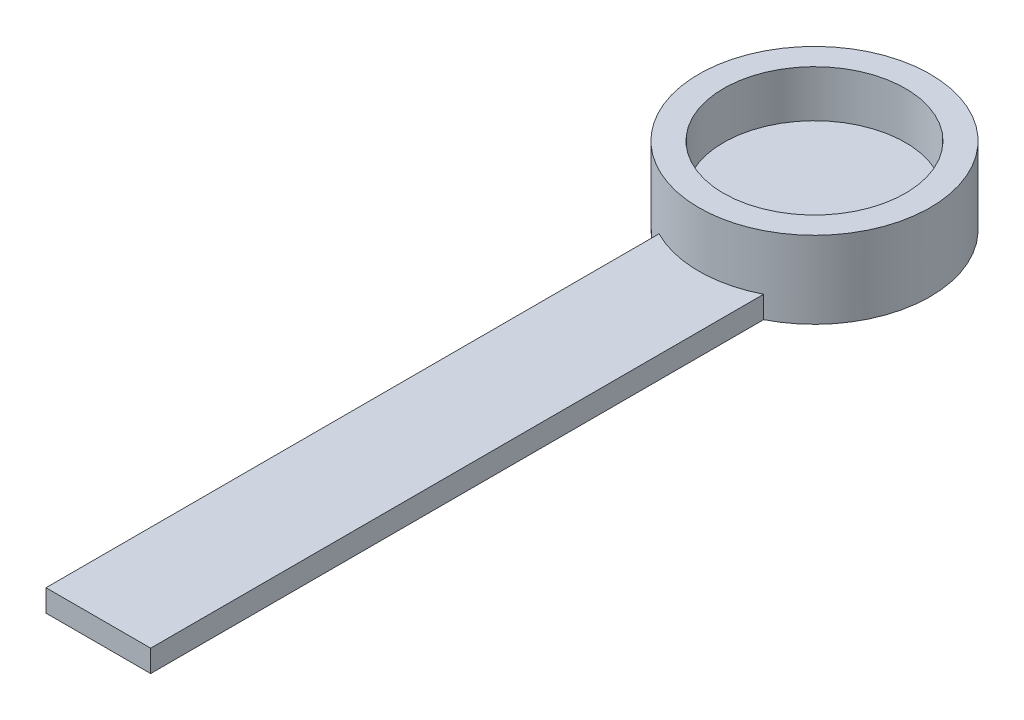
ISO-10303-21;
HEADER;
FILE_DESCRIPTION(('STEP AP214'),'2;1');
FILE_NAME('part.step','',(''),(''),'','','');
FILE_SCHEMA(('AUTOMOTIVE_DESIGN { 1 0 10303 214 1 1 1 1 }'));
ENDSEC;
DATA;
#1=APPLICATION_CONTEXT('core data for automotive mechanical design processes');
#2=APPLICATION_PROTOCOL_DEFINITION('international standard','automotive_design',2000,#1);
#3=PRODUCT_CONTEXT('',#1,'mechanical');
#4=PRODUCT('Part','Part','',(#3));
#5=PRODUCT_RELATED_PRODUCT_CATEGORY('part','',(#4));
#6=PRODUCT_DEFINITION_FORMATION('','',#4);
#7=PRODUCT_DEFINITION_CONTEXT('part definition',#1,'design');
#8=PRODUCT_DEFINITION('design','',#6,#7);
#9=PRODUCT_DEFINITION_SHAPE('','',#8);
#10=(LENGTH_UNIT() NAMED_UNIT(*) SI_UNIT(.MILLI.,.METRE.));
#11=(NAMED_UNIT(*) PLANE_ANGLE_UNIT() SI_UNIT($,.RADIAN.));
#12=(NAMED_UNIT(*) SI_UNIT($,.STERADIAN.) SOLID_ANGLE_UNIT());
#13=UNCERTAINTY_MEASURE_WITH_UNIT(LENGTH_MEASURE(1.E-05),#10,'distance_accuracy_value','');
#14=(GEOMETRIC_REPRESENTATION_CONTEXT(3) GLOBAL_UNCERTAINTY_ASSIGNED_CONTEXT((#13)) GLOBAL_UNIT_ASSIGNED_CONTEXT((#10,
#11,#12)) REPRESENTATION_CONTEXT('',''));
#15=CARTESIAN_POINT('',(0.,0.,0.));
#16=DIRECTION('',(0.,0.,1.));
#17=DIRECTION('',(1.,0.,0.));
#18=AXIS2_PLACEMENT_3D('',#15,#16,#17);
#19=CARTESIAN_POINT('',(0.,7.,0.));
#20=DIRECTION('',(0.,-1.,0.));
#21=DIRECTION('',(0.,0.,-1.));
#22=AXIS2_PLACEMENT_3D('',#19,#20,#21);
#23=CYLINDRICAL_SURFACE('',#22,8.25);
#24=CARTESIAN_POINT('',(0.,7.,0.));
#25=DIRECTION('',(0.,1.,0.));
#26=DIRECTION('',(0.,0.,1.));
#27=AXIS2_PLACEMENT_3D('',#24,#25,#26);
#28=CIRCLE('',#27,8.25);
#29=CARTESIAN_POINT('',(0.,7.,8.25));
#30=VERTEX_POINT('',#29);
#31=EDGE_CURVE('E206',#30,#30,#28,.T.);
#32=ORIENTED_EDGE('',*,*,#31,.T.);
#33=EDGE_LOOP('',(#32));
#34=FACE_BOUND('',#33,.T.);
#35=CARTESIAN_POINT('',(0.,4.75,0.));
#36=DIRECTION('',(0.,1.,0.));
#37=DIRECTION('',(0.,0.,1.));
#38=AXIS2_PLACEMENT_3D('',#35,#36,#37);
#39=CIRCLE('',#38,8.25);
#40=CARTESIAN_POINT('',(-0.75,4.75,8.21583836257749));
#41=VERTEX_POINT('',#40);
#42=CARTESIAN_POINT('',(0.75,4.75,8.21583836257749));
#43=VERTEX_POINT('',#42);
#44=EDGE_CURVE('E184',#41,#43,#39,.T.);
#45=ORIENTED_EDGE('',*,*,#44,.F.);
#46=CARTESIAN_POINT('',(-0.75,4.75,8.21583836257749));
#47=CARTESIAN_POINT('',(-0.764129221551779,4.75001161341339,8.21454996122284));
#48=CARTESIAN_POINT('',(-0.778251039669117,4.74880290447525,8.21322269564521));
#49=CARTESIAN_POINT('',(-0.806078895124546,4.74403425371426,8.21053749097257));
#50=CARTESIAN_POINT('',(-0.819785226220468,4.7404760156203,8.20917957479202));
#51=CARTESIAN_POINT('',(-0.84640883031633,4.73109533210837,8.20647750519365));
#52=CARTESIAN_POINT('',(-0.859325739010222,4.72527185031039,8.2051333583648));
#53=CARTESIAN_POINT('',(-0.883995941785533,4.71152851564804,8.20251210094606));
#54=CARTESIAN_POINT('',(-0.895749441725187,4.70360903457258,8.20123497851545));
#55=CARTESIAN_POINT('',(-0.917753098340607,4.68589854866679,8.19880186707717));
#56=CARTESIAN_POINT('',(-0.92800413804788,4.67610865098213,8.19764580703327));
#57=CARTESIAN_POINT('',(-0.94671693028953,4.65492627305538,8.19550583979909));
#58=CARTESIAN_POINT('',(-0.955178364048698,4.64353350790186,8.19452196328455));
#59=CARTESIAN_POINT('',(-0.970026706937175,4.61952665823131,8.19277755291973));
#60=CARTESIAN_POINT('',(-0.976422965343667,4.60691842322988,8.19201601406737));
#61=CARTESIAN_POINT('',(-0.987002101335757,4.58079734052133,8.19074816084985));
#62=CARTESIAN_POINT('',(-0.991186488854643,4.56728511703882,8.19024167238579));
#63=CARTESIAN_POINT('',(-0.996129852529126,4.54473499724551,8.18964156950122));
#64=CARTESIAN_POINT('',(-0.997580242977253,4.53584482180575,8.18946489561978));
#65=CARTESIAN_POINT('',(-0.999515169190639,4.51797107836416,8.18922888383138));
#66=CARTESIAN_POINT('',(-1.00000105495711,4.5089876586163,8.18916938192169));
#67=CARTESIAN_POINT('',(-1.00000000000077,4.50000000000016,8.18916967707999));
#68=B_SPLINE_CURVE_WITH_KNOTS('',3,(#46,#47,#48,#49,#50,#51,#52,#53,#54,#55,#56,#57,#58,#59,#60,
#61,#62,#63,#64,#65,#66,#67),.UNSPECIFIED.,.F.,.F.,(4,2,2,2,2,2,2,2,2,2,4),(0.,
0.0425066362152133,0.084982483124767,0.127477786215973,0.169965556524714,0.212428254759499,
0.254898510343261,0.297173710996858,0.339420015100162,0.366399209454952,0.393340614776967),.UNSPECIFIED.);
#69=CARTESIAN_POINT('',(-1.,4.5,8.1891696770796));
#70=VERTEX_POINT('',#69);
#71=EDGE_CURVE('E252',#41,#70,#68,.T.);
#72=ORIENTED_EDGE('',*,*,#71,.T.);
#73=DIRECTION('',(0.,-1.,0.));
#74=VECTOR('',#73,1.);
#75=CARTESIAN_POINT('',(-1.,4.75,8.1891696770796));
#76=LINE('',#75,#74);
#77=CARTESIAN_POINT('',(-1.,2.75,8.1891696770796));
#78=VERTEX_POINT('',#77);
#79=EDGE_CURVE('E203',#70,#78,#76,.T.);
#80=ORIENTED_EDGE('',*,*,#79,.T.);
#81=CARTESIAN_POINT('',(0.,2.75,0.));
#82=DIRECTION('',(0.,1.,0.));
#83=DIRECTION('',(0.,0.,1.));
#84=AXIS2_PLACEMENT_3D('',#81,#82,#83);
#85=CIRCLE('',#84,8.25);
#86=CARTESIAN_POINT('',(1.,2.75,8.1891696770796));
#87=VERTEX_POINT('',#86);
#88=EDGE_CURVE('E217',#78,#87,#85,.F.);
#89=ORIENTED_EDGE('',*,*,#88,.T.);
#90=DIRECTION('',(0.,-1.,0.));
#91=VECTOR('',#90,1.);
#92=CARTESIAN_POINT('',(0.999999999999999,4.75,8.1891696770796));
#93=LINE('',#92,#91);
#94=CARTESIAN_POINT('',(0.999999999999999,4.5,8.1891696770796));
#95=VERTEX_POINT('',#94);
#96=EDGE_CURVE('E188',#95,#87,#93,.T.);
#97=ORIENTED_EDGE('',*,*,#96,.F.);
#98=CARTESIAN_POINT('',(1.,4.5,8.1891696770796));
#99=CARTESIAN_POINT('',(1.00001226422762,4.51399502917828,8.18916715775935));
#100=CARTESIAN_POINT('',(0.998825589352925,4.52798573053127,8.18931307201345));
#101=CARTESIAN_POINT('',(0.994145793215527,4.55555599314485,8.18988303424555));
#102=CARTESIAN_POINT('',(0.990655035739588,4.56913596086538,8.1903067971722));
#103=CARTESIAN_POINT('',(0.981456358849237,4.59551771046388,8.1914140112854));
#104=CARTESIAN_POINT('',(0.975747569415343,4.60831918469741,8.19209756437193));
#105=CARTESIAN_POINT('',(0.962284101281528,4.63277883580666,8.19368997383611));
#106=CARTESIAN_POINT('',(0.954529635175436,4.64443713131291,8.19459880680131));
#107=CARTESIAN_POINT('',(0.937164103851531,4.66632969079791,8.19660294280925));
#108=CARTESIAN_POINT('',(0.927546298355228,4.67655854554457,8.19769892105363));
#109=CARTESIAN_POINT('',(0.906744127348434,4.69526118400607,8.2000258794824));
#110=CARTESIAN_POINT('',(0.895559424028606,4.70373458828223,8.20125688876584));
#111=CARTESIAN_POINT('',(0.871861091489875,4.71874177501779,8.20381015546245));
#112=CARTESIAN_POINT('',(0.859339066991687,4.72526219285857,8.20513296856957));
#113=CARTESIAN_POINT('',(0.833382955048964,4.73610341320482,8.20780985583175));
#114=CARTESIAN_POINT('',(0.819949361588187,4.74042539643302,8.20916391279714));
#115=CARTESIAN_POINT('',(0.797034475048519,4.74571830400974,8.21141413192285));
#116=CARTESIAN_POINT('',(0.787695004810799,4.74732263761865,8.21231543373788));
#117=CARTESIAN_POINT('',(0.768905499457665,4.74946341565931,8.21409606931658));
#118=CARTESIAN_POINT('',(0.759455632937118,4.75000131689845,8.21497543142632));
#119=CARTESIAN_POINT('',(0.750000000000396,4.75000000000171,8.21583836257751));
#120=B_SPLINE_CURVE_WITH_KNOTS('',3,(#98,#99,#100,#101,#102,#103,#104,#105,#106,#107,#108,#109,
#110,#111,#112,#113,#114,#115,#116,#117,#118,#119),.UNSPECIFIED.,.F.,.F.,(4,2,2,2,2,2,2,2,2,2,
4),(0.,0.0419277652389413,0.0838125829838669,0.125713846594998,0.167610757395424,
0.209662151688062,0.251722625881799,0.294064675425708,0.336383960068434,0.364884263259365,
0.393345606512269),.UNSPECIFIED.);
#121=EDGE_CURVE('E261',#95,#43,#120,.T.);
#122=ORIENTED_EDGE('',*,*,#121,.T.);
#123=EDGE_LOOP('',(#45,#72,#80,#89,#97,#122));
#124=FACE_BOUND('',#123,.T.);
#125=ADVANCED_FACE('F47',(#34,#124),#23,.F.);
#126=CARTESIAN_POINT('',(0.,2.75,0.));
#127=DIRECTION('',(0.,1.,0.));
#128=DIRECTION('',(0.,0.,1.));
#129=AXIS2_PLACEMENT_3D('',#126,#127,#128);
#130=PLANE('',#129);
#131=ORIENTED_EDGE('',*,*,#88,.F.);
#132=DIRECTION('',(0.,0.,1.));
#133=VECTOR('',#132,1.);
#134=CARTESIAN_POINT('',(-1.,2.75,8.1891696770796));
#135=LINE('',#134,#133);
#136=CARTESIAN_POINT('',(-1.,2.75,7.3));
#137=VERTEX_POINT('',#136);
#138=EDGE_CURVE('E194',#137,#78,#135,.T.);
#139=ORIENTED_EDGE('',*,*,#138,.F.);
#140=CARTESIAN_POINT('',(-0.75,2.75,7.3));
#141=DIRECTION('',(0.,1.,0.));
#142=DIRECTION('',(0.,0.,1.));
#143=AXIS2_PLACEMENT_3D('',#140,#141,#142);
#144=CIRCLE('',#143,0.25);
#145=CARTESIAN_POINT('',(-0.75,2.75,7.05));
#146=VERTEX_POINT('',#145);
#147=EDGE_CURVE('E11',#137,#146,#144,.F.);
#148=ORIENTED_EDGE('',*,*,#147,.T.);
#149=DIRECTION('',(-1.,0.,0.));
#150=VECTOR('',#149,1.);
#151=CARTESIAN_POINT('',(-1.,2.75,7.05));
#152=LINE('',#151,#150);
#153=CARTESIAN_POINT('',(0.75,2.75,7.05));
#154=VERTEX_POINT('',#153);
#155=EDGE_CURVE('E190',#154,#146,#152,.T.);
#156=ORIENTED_EDGE('',*,*,#155,.F.);
#157=CARTESIAN_POINT('',(0.75,2.75,7.3));
#158=DIRECTION('',(0.,1.,0.));
#159=DIRECTION('',(0.,0.,1.));
#160=AXIS2_PLACEMENT_3D('',#157,#158,#159);
#161=CIRCLE('',#160,0.25);
#162=CARTESIAN_POINT('',(1.,2.75,7.3));
#163=VERTEX_POINT('',#162);
#164=EDGE_CURVE('E57',#154,#163,#161,.F.);
#165=ORIENTED_EDGE('',*,*,#164,.T.);
#166=DIRECTION('',(0.,0.,-1.));
#167=VECTOR('',#166,1.);
#168=CARTESIAN_POINT('',(1.,2.75,7.05));
#169=LINE('',#168,#167);
#170=EDGE_CURVE('E189',#87,#163,#169,.T.);
#171=ORIENTED_EDGE('',*,*,#170,.F.);
#172=EDGE_LOOP('',(#131,#139,#148,#156,#165,#171));
#173=FACE_BOUND('',#172,.T.);
#174=ADVANCED_FACE('F275',(#173),#130,.T.);
#175=CARTESIAN_POINT('',(0.,2.75,0.));
#176=DIRECTION('',(0.,-1.,0.));
#177=DIRECTION('',(0.,0.,-1.));
#178=AXIS2_PLACEMENT_3D('',#175,#176,#177);
#179=CYLINDRICAL_SURFACE('',#178,10.5);
#180=CARTESIAN_POINT('',(0.,2.,0.));
#181=DIRECTION('',(0.,1.,0.));
#182=DIRECTION('',(0.,0.,-1.));
#183=AXIS2_PLACEMENT_3D('',#180,#181,#182);
#184=CIRCLE('',#183,10.5);
#185=CARTESIAN_POINT('',(-4.75,2.,9.36416040016402));
#186=VERTEX_POINT('',#185);
#187=CARTESIAN_POINT('',(4.75,2.,9.36416040016402));
#188=VERTEX_POINT('',#187);
#189=EDGE_CURVE('E69',#186,#188,#184,.T.);
#190=ORIENTED_EDGE('',*,*,#189,.T.);
#191=DIRECTION('',(0.,-1.,0.));
#192=VECTOR('',#191,1.);
#193=CARTESIAN_POINT('',(4.75,2.,9.36416040016402));
#194=LINE('',#193,#192);
#195=CARTESIAN_POINT('',(4.75,0.,9.36416040016402));
#196=VERTEX_POINT('',#195);
#197=EDGE_CURVE('E179',#188,#196,#194,.T.);
#198=ORIENTED_EDGE('',*,*,#197,.T.);
#199=CARTESIAN_POINT('',(0.,0.,0.));
#200=DIRECTION('',(0.,1.,0.));
#201=DIRECTION('',(0.,0.,1.));
#202=AXIS2_PLACEMENT_3D('',#199,#200,#201);
#203=CIRCLE('',#202,10.5);
#204=CARTESIAN_POINT('',(-4.75,0.,9.36416040016402));
#205=VERTEX_POINT('',#204);
#206=EDGE_CURVE('E214',#196,#205,#203,.T.);
#207=ORIENTED_EDGE('',*,*,#206,.T.);
#208=DIRECTION('',(0.,-1.,0.));
#209=VECTOR('',#208,1.);
#210=CARTESIAN_POINT('',(-4.75,2.,9.36416040016402));
#211=LINE('',#210,#209);
#212=EDGE_CURVE('E65',#186,#205,#211,.T.);
#213=ORIENTED_EDGE('',*,*,#212,.F.);
#214=EDGE_LOOP('',(#190,#198,#207,#213));
#215=FACE_BOUND('',#214,.T.);
#216=CARTESIAN_POINT('',(0.,7.,0.));
#217=DIRECTION('',(0.,1.,0.));
#218=DIRECTION('',(0.,0.,1.));
#219=AXIS2_PLACEMENT_3D('',#216,#217,#218);
#220=CIRCLE('',#219,10.5);
#221=CARTESIAN_POINT('',(0.,7.,10.5));
#222=VERTEX_POINT('',#221);
#223=EDGE_CURVE('E210',#222,#222,#220,.T.);
#224=ORIENTED_EDGE('',*,*,#223,.F.);
#225=EDGE_LOOP('',(#224));
#226=FACE_BOUND('',#225,.T.);
#227=ADVANCED_FACE('F287',(#215,#226),#179,.T.);
#228=CARTESIAN_POINT('',(0.,0.,0.));
#229=DIRECTION('',(0.,1.,0.));
#230=DIRECTION('',(0.,0.,1.));
#231=AXIS2_PLACEMENT_3D('',#228,#229,#230);
#232=PLANE('',#231);
#233=ORIENTED_EDGE('',*,*,#206,.F.);
#234=DIRECTION('',(0.,0.,1.));
#235=VECTOR('',#234,1.);
#236=CARTESIAN_POINT('',(4.75,0.,65.));
#237=LINE('',#236,#235);
#238=CARTESIAN_POINT('',(4.75,0.,65.));
#239=VERTEX_POINT('',#238);
#240=EDGE_CURVE('E161',#196,#239,#237,.T.);
#241=ORIENTED_EDGE('',*,*,#240,.T.);
#242=DIRECTION('',(-1.,0.,0.));
#243=VECTOR('',#242,1.);
#244=CARTESIAN_POINT('',(-4.75,0.,65.));
#245=LINE('',#244,#243);
#246=CARTESIAN_POINT('',(-4.75,0.,65.));
#247=VERTEX_POINT('',#246);
#248=EDGE_CURVE('E171',#239,#247,#245,.T.);
#249=ORIENTED_EDGE('',*,*,#248,.T.);
#250=DIRECTION('',(0.,0.,-1.));
#251=VECTOR('',#250,1.);
#252=CARTESIAN_POINT('',(-4.75,0.,9.36416040016402));
#253=LINE('',#252,#251);
#254=EDGE_CURVE('E142',#247,#205,#253,.T.);
#255=ORIENTED_EDGE('',*,*,#254,.T.);
#256=EDGE_LOOP('',(#233,#241,#249,#255));
#257=FACE_BOUND('',#256,.T.);
#258=ADVANCED_FACE('F283',(#257),#232,.F.);
#259=CARTESIAN_POINT('',(0.,7.,0.));
#260=DIRECTION('',(0.,1.,0.));
#261=DIRECTION('',(0.,0.,1.));
#262=AXIS2_PLACEMENT_3D('',#259,#260,#261);
#263=PLANE('',#262);
#264=ORIENTED_EDGE('',*,*,#223,.T.);
#265=EDGE_LOOP('',(#264));
#266=FACE_BOUND('',#265,.T.);
#267=ORIENTED_EDGE('',*,*,#31,.F.);
#268=EDGE_LOOP('',(#267));
#269=FACE_BOUND('',#268,.T.);
#270=ADVANCED_FACE('F279',(#266,#269),#263,.T.);
#271=CARTESIAN_POINT('',(-1.,4.75,7.05));
#272=DIRECTION('',(0.,0.,1.));
#273=DIRECTION('',(1.,0.,0.));
#274=AXIS2_PLACEMENT_3D('',#271,#272,#273);
#275=PLANE('',#274);
#276=DIRECTION('',(-1.,0.,0.));
#277=VECTOR('',#276,1.);
#278=CARTESIAN_POINT('',(1.,4.5,7.05));
#279=LINE('',#278,#277);
#280=CARTESIAN_POINT('',(-0.75,4.5,7.05));
#281=VERTEX_POINT('',#280);
#282=CARTESIAN_POINT('',(0.75,4.5,7.05));
#283=VERTEX_POINT('',#282);
#284=EDGE_CURVE('E246',#281,#283,#279,.F.);
#285=ORIENTED_EDGE('',*,*,#284,.T.);
#286=DIRECTION('',(0.,-1.,0.));
#287=VECTOR('',#286,1.);
#288=CARTESIAN_POINT('',(0.75,4.75,7.05));
#289=LINE('',#288,#287);
#290=EDGE_CURVE('E249',#283,#154,#289,.T.);
#291=ORIENTED_EDGE('',*,*,#290,.T.);
#292=ORIENTED_EDGE('',*,*,#155,.T.);
#293=DIRECTION('',(0.,-1.,0.));
#294=VECTOR('',#293,1.);
#295=CARTESIAN_POINT('',(-0.75,4.75,7.05));
#296=LINE('',#295,#294);
#297=EDGE_CURVE('E243',#146,#281,#296,.F.);
#298=ORIENTED_EDGE('',*,*,#297,.T.);
#299=EDGE_LOOP('',(#285,#291,#292,#298));
#300=FACE_BOUND('',#299,.T.);
#301=ADVANCED_FACE('F277',(#300),#275,.F.);
#302=CARTESIAN_POINT('',(-1.,4.75,8.1891696770796));
#303=DIRECTION('',(1.,0.,0.));
#304=DIRECTION('',(0.,0.,-1.));
#305=AXIS2_PLACEMENT_3D('',#302,#303,#304);
#306=PLANE('',#305);
#307=ORIENTED_EDGE('',*,*,#79,.F.);
#308=DIRECTION('',(0.,0.,1.));
#309=VECTOR('',#308,1.);
#310=CARTESIAN_POINT('',(-1.,4.5,7.05));
#311=LINE('',#310,#309);
#312=CARTESIAN_POINT('',(-1.,4.5,7.3));
#313=VERTEX_POINT('',#312);
#314=EDGE_CURVE('E234',#70,#313,#311,.F.);
#315=ORIENTED_EDGE('',*,*,#314,.T.);
#316=DIRECTION('',(0.,-1.,0.));
#317=VECTOR('',#316,1.);
#318=CARTESIAN_POINT('',(-1.,4.75,7.3));
#319=LINE('',#318,#317);
#320=EDGE_CURVE('E231',#313,#137,#319,.T.);
#321=ORIENTED_EDGE('',*,*,#320,.T.);
#322=ORIENTED_EDGE('',*,*,#138,.T.);
#323=EDGE_LOOP('',(#307,#315,#321,#322));
#324=FACE_BOUND('',#323,.T.);
#325=ADVANCED_FACE('F346',(#324),#306,.F.);
#326=CARTESIAN_POINT('',(1.,4.75,7.05));
#327=DIRECTION('',(-1.,0.,0.));
#328=DIRECTION('',(0.,0.,1.));
#329=AXIS2_PLACEMENT_3D('',#326,#327,#328);
#330=PLANE('',#329);
#331=DIRECTION('',(0.,-1.,0.));
#332=VECTOR('',#331,1.);
#333=CARTESIAN_POINT('',(1.,4.75,7.3));
#334=LINE('',#333,#332);
#335=CARTESIAN_POINT('',(1.,4.5,7.3));
#336=VERTEX_POINT('',#335);
#337=EDGE_CURVE('E237',#163,#336,#334,.F.);
#338=ORIENTED_EDGE('',*,*,#337,.T.);
#339=DIRECTION('',(0.,0.,-1.));
#340=VECTOR('',#339,1.);
#341=CARTESIAN_POINT('',(1.,4.5,8.1891696770796));
#342=LINE('',#341,#340);
#343=EDGE_CURVE('E240',#336,#95,#342,.F.);
#344=ORIENTED_EDGE('',*,*,#343,.T.);
#345=ORIENTED_EDGE('',*,*,#96,.T.);
#346=ORIENTED_EDGE('',*,*,#170,.T.);
#347=EDGE_LOOP('',(#338,#344,#345,#346));
#348=FACE_BOUND('',#347,.T.);
#349=ADVANCED_FACE('F366',(#348),#330,.F.);
#350=CARTESIAN_POINT('',(0.,4.75,0.));
#351=DIRECTION('',(0.,1.,0.));
#352=DIRECTION('',(0.,0.,1.));
#353=AXIS2_PLACEMENT_3D('',#350,#351,#352);
#354=PLANE('',#353);
#355=DIRECTION('',(-1.,0.,0.));
#356=VECTOR('',#355,1.);
#357=CARTESIAN_POINT('',(-1.,4.75,7.3));
#358=LINE('',#357,#356);
#359=CARTESIAN_POINT('',(0.75,4.75,7.3));
#360=VERTEX_POINT('',#359);
#361=CARTESIAN_POINT('',(-0.75,4.75,7.3));
#362=VERTEX_POINT('',#361);
#363=EDGE_CURVE('E221',#360,#362,#358,.T.);
#364=ORIENTED_EDGE('',*,*,#363,.T.);
#365=DIRECTION('',(0.,0.,1.));
#366=VECTOR('',#365,1.);
#367=CARTESIAN_POINT('',(-0.75,4.75,8.1891696770796));
#368=LINE('',#367,#366);
#369=EDGE_CURVE('E227',#362,#41,#368,.T.);
#370=ORIENTED_EDGE('',*,*,#369,.T.);
#371=ORIENTED_EDGE('',*,*,#44,.T.);
#372=DIRECTION('',(0.,0.,-1.));
#373=VECTOR('',#372,1.);
#374=CARTESIAN_POINT('',(0.75,4.75,7.05));
#375=LINE('',#374,#373);
#376=EDGE_CURVE('E224',#43,#360,#375,.T.);
#377=ORIENTED_EDGE('',*,*,#376,.T.);
#378=EDGE_LOOP('',(#364,#370,#371,#377));
#379=FACE_BOUND('',#378,.T.);
#380=ADVANCED_FACE('F306',(#379),#354,.T.);
#381=CARTESIAN_POINT('',(0.75,4.75,7.3));
#382=DIRECTION('',(0.,-1.,0.));
#383=DIRECTION('',(0.,0.,-1.));
#384=AXIS2_PLACEMENT_3D('',#381,#382,#383);
#385=CYLINDRICAL_SURFACE('',#384,0.25);
#386=ORIENTED_EDGE('',*,*,#164,.F.);
#387=ORIENTED_EDGE('',*,*,#290,.F.);
#388=CARTESIAN_POINT('',(0.75,4.5,7.3));
#389=DIRECTION('',(0.,1.,0.));
#390=DIRECTION('',(0.,0.,1.));
#391=AXIS2_PLACEMENT_3D('',#388,#389,#390);
#392=CIRCLE('',#391,0.25);
#393=EDGE_CURVE('E51',#336,#283,#392,.T.);
#394=ORIENTED_EDGE('',*,*,#393,.F.);
#395=ORIENTED_EDGE('',*,*,#337,.F.);
#396=EDGE_LOOP('',(#386,#387,#394,#395));
#397=FACE_BOUND('',#396,.T.);
#398=ADVANCED_FACE('F49',(#397),#385,.T.);
#399=CARTESIAN_POINT('',(0.75,4.5,0.));
#400=DIRECTION('',(0.,0.,1.));
#401=DIRECTION('',(1.,0.,0.));
#402=AXIS2_PLACEMENT_3D('',#399,#400,#401);
#403=CYLINDRICAL_SURFACE('',#402,0.25);
#404=ORIENTED_EDGE('',*,*,#121,.F.);
#405=ORIENTED_EDGE('',*,*,#343,.F.);
#406=CARTESIAN_POINT('',(0.75,4.5,7.3));
#407=DIRECTION('',(0.,0.,-1.));
#408=DIRECTION('',(-1.,0.,0.));
#409=AXIS2_PLACEMENT_3D('',#406,#407,#408);
#410=CIRCLE('',#409,0.25);
#411=EDGE_CURVE('E313',#360,#336,#410,.T.);
#412=ORIENTED_EDGE('',*,*,#411,.F.);
#413=ORIENTED_EDGE('',*,*,#376,.F.);
#414=EDGE_LOOP('',(#404,#405,#412,#413));
#415=FACE_BOUND('',#414,.T.);
#416=ADVANCED_FACE('F310',(#415),#403,.T.);
#417=CARTESIAN_POINT('',(0.75,4.5,7.3));
#418=DIRECTION('',(1.,0.,0.));
#419=DIRECTION('',(0.,0.,-1.));
#420=AXIS2_PLACEMENT_3D('',#417,#418,#419);
#421=SPHERICAL_SURFACE('',#420,0.25);
#422=ORIENTED_EDGE('',*,*,#411,.T.);
#423=ORIENTED_EDGE('',*,*,#393,.T.);
#424=CARTESIAN_POINT('',(0.75,4.5,7.3));
#425=DIRECTION('',(1.,0.,0.));
#426=DIRECTION('',(0.,0.,-1.));
#427=AXIS2_PLACEMENT_3D('',#424,#425,#426);
#428=CIRCLE('',#427,0.25);
#429=EDGE_CURVE('E319',#360,#283,#428,.F.);
#430=ORIENTED_EDGE('',*,*,#429,.F.);
#431=EDGE_LOOP('',(#422,#423,#430));
#432=FACE_BOUND('',#431,.T.);
#433=ADVANCED_FACE('F322',(#432),#421,.T.);
#434=CARTESIAN_POINT('',(-0.75,4.75,7.3));
#435=DIRECTION('',(0.,-1.,0.));
#436=DIRECTION('',(0.,0.,-1.));
#437=AXIS2_PLACEMENT_3D('',#434,#435,#436);
#438=CYLINDRICAL_SURFACE('',#437,0.25);
#439=ORIENTED_EDGE('',*,*,#147,.F.);
#440=ORIENTED_EDGE('',*,*,#320,.F.);
#441=CARTESIAN_POINT('',(-0.75,4.5,7.3));
#442=DIRECTION('',(0.,1.,0.));
#443=DIRECTION('',(0.,0.,1.));
#444=AXIS2_PLACEMENT_3D('',#441,#442,#443);
#445=CIRCLE('',#444,0.25);
#446=EDGE_CURVE('E326',#281,#313,#445,.T.);
#447=ORIENTED_EDGE('',*,*,#446,.F.);
#448=ORIENTED_EDGE('',*,*,#297,.F.);
#449=EDGE_LOOP('',(#439,#440,#447,#448));
#450=FACE_BOUND('',#449,.T.);
#451=ADVANCED_FACE('F350',(#450),#438,.T.);
#452=CARTESIAN_POINT('',(0.,4.5,7.3));
#453=DIRECTION('',(1.,0.,0.));
#454=DIRECTION('',(0.,0.,-1.));
#455=AXIS2_PLACEMENT_3D('',#452,#453,#454);
#456=CYLINDRICAL_SURFACE('',#455,0.25);
#457=ORIENTED_EDGE('',*,*,#429,.T.);
#458=ORIENTED_EDGE('',*,*,#284,.F.);
#459=CARTESIAN_POINT('',(-0.75,4.5,7.3));
#460=DIRECTION('',(-1.,0.,0.));
#461=DIRECTION('',(0.,0.,1.));
#462=AXIS2_PLACEMENT_3D('',#459,#460,#461);
#463=CIRCLE('',#462,0.25);
#464=EDGE_CURVE('E331',#362,#281,#463,.T.);
#465=ORIENTED_EDGE('',*,*,#464,.F.);
#466=ORIENTED_EDGE('',*,*,#363,.F.);
#467=EDGE_LOOP('',(#457,#458,#465,#466));
#468=FACE_BOUND('',#467,.T.);
#469=ADVANCED_FACE('F329',(#468),#456,.T.);
#470=CARTESIAN_POINT('',(-0.75,4.5,7.3));
#471=DIRECTION('',(0.,0.,-1.));
#472=DIRECTION('',(-1.,0.,0.));
#473=AXIS2_PLACEMENT_3D('',#470,#471,#472);
#474=SPHERICAL_SURFACE('',#473,0.25);
#475=ORIENTED_EDGE('',*,*,#464,.T.);
#476=ORIENTED_EDGE('',*,*,#446,.T.);
#477=CARTESIAN_POINT('',(-0.75,4.5,7.3));
#478=DIRECTION('',(0.,0.,-1.));
#479=DIRECTION('',(-1.,0.,0.));
#480=AXIS2_PLACEMENT_3D('',#477,#478,#479);
#481=CIRCLE('',#480,0.25);
#482=EDGE_CURVE('E178',#362,#313,#481,.F.);
#483=ORIENTED_EDGE('',*,*,#482,.F.);
#484=EDGE_LOOP('',(#475,#476,#483));
#485=FACE_BOUND('',#484,.T.);
#486=ADVANCED_FACE('F339',(#485),#474,.T.);
#487=CARTESIAN_POINT('',(-0.75,4.5,0.));
#488=DIRECTION('',(0.,0.,-1.));
#489=DIRECTION('',(-1.,0.,0.));
#490=AXIS2_PLACEMENT_3D('',#487,#488,#489);
#491=CYLINDRICAL_SURFACE('',#490,0.25);
#492=ORIENTED_EDGE('',*,*,#482,.T.);
#493=ORIENTED_EDGE('',*,*,#314,.F.);
#494=ORIENTED_EDGE('',*,*,#71,.F.);
#495=ORIENTED_EDGE('',*,*,#369,.F.);
#496=EDGE_LOOP('',(#492,#493,#494,#495));
#497=FACE_BOUND('',#496,.T.);
#498=ADVANCED_FACE('F267',(#497),#491,.T.);
#499=CARTESIAN_POINT('',(-4.75,2.,65.));
#500=DIRECTION('',(0.,0.,1.));
#501=DIRECTION('',(1.,0.,0.));
#502=AXIS2_PLACEMENT_3D('',#499,#500,#501);
#503=PLANE('',#502);
#504=ORIENTED_EDGE('',*,*,#248,.F.);
#505=DIRECTION('',(0.,-1.,0.));
#506=VECTOR('',#505,1.);
#507=CARTESIAN_POINT('',(4.75,2.,65.));
#508=LINE('',#507,#506);
#509=CARTESIAN_POINT('',(4.75,2.,65.));
#510=VERTEX_POINT('',#509);
#511=EDGE_CURVE('E159',#510,#239,#508,.T.);
#512=ORIENTED_EDGE('',*,*,#511,.F.);
#513=DIRECTION('',(-1.,0.,0.));
#514=VECTOR('',#513,1.);
#515=CARTESIAN_POINT('',(-4.75,2.,65.));
#516=LINE('',#515,#514);
#517=CARTESIAN_POINT('',(-4.75,2.,65.));
#518=VERTEX_POINT('',#517);
#519=EDGE_CURVE('E154',#510,#518,#516,.T.);
#520=ORIENTED_EDGE('',*,*,#519,.T.);
#521=DIRECTION('',(0.,-1.,0.));
#522=VECTOR('',#521,1.);
#523=CARTESIAN_POINT('',(-4.75,2.,65.));
#524=LINE('',#523,#522);
#525=EDGE_CURVE('E137',#518,#247,#524,.T.);
#526=ORIENTED_EDGE('',*,*,#525,.T.);
#527=EDGE_LOOP('',(#504,#512,#520,#526));
#528=FACE_BOUND('',#527,.T.);
#529=ADVANCED_FACE('F158',(#528),#503,.T.);
#530=CARTESIAN_POINT('',(4.75,2.,65.));
#531=DIRECTION('',(1.,0.,0.));
#532=DIRECTION('',(0.,0.,-1.));
#533=AXIS2_PLACEMENT_3D('',#530,#531,#532);
#534=PLANE('',#533);
#535=ORIENTED_EDGE('',*,*,#240,.F.);
#536=ORIENTED_EDGE('',*,*,#197,.F.);
#537=DIRECTION('',(0.,0.,1.));
#538=VECTOR('',#537,1.);
#539=CARTESIAN_POINT('',(4.75,2.,65.));
#540=LINE('',#539,#538);
#541=EDGE_CURVE('E148',#188,#510,#540,.T.);
#542=ORIENTED_EDGE('',*,*,#541,.T.);
#543=ORIENTED_EDGE('',*,*,#511,.T.);
#544=EDGE_LOOP('',(#535,#536,#542,#543));
#545=FACE_BOUND('',#544,.T.);
#546=ADVANCED_FACE('F377',(#545),#534,.T.);
#547=CARTESIAN_POINT('',(-4.75,2.,9.36416040016402));
#548=DIRECTION('',(-1.,0.,0.));
#549=DIRECTION('',(0.,0.,1.));
#550=AXIS2_PLACEMENT_3D('',#547,#548,#549);
#551=PLANE('',#550);
#552=ORIENTED_EDGE('',*,*,#254,.F.);
#553=ORIENTED_EDGE('',*,*,#525,.F.);
#554=DIRECTION('',(0.,0.,-1.));
#555=VECTOR('',#554,1.);
#556=CARTESIAN_POINT('',(-4.75,2.,9.36416040016402));
#557=LINE('',#556,#555);
#558=EDGE_CURVE('E140',#518,#186,#557,.T.);
#559=ORIENTED_EDGE('',*,*,#558,.T.);
#560=ORIENTED_EDGE('',*,*,#212,.T.);
#561=EDGE_LOOP('',(#552,#553,#559,#560));
#562=FACE_BOUND('',#561,.T.);
#563=ADVANCED_FACE('F139',(#562),#551,.T.);
#564=CARTESIAN_POINT('',(0.,2.,0.));
#565=DIRECTION('',(0.,-1.,0.));
#566=DIRECTION('',(0.,0.,-1.));
#567=AXIS2_PLACEMENT_3D('',#564,#565,#566);
#568=PLANE('',#567);
#569=ORIENTED_EDGE('',*,*,#519,.F.);
#570=ORIENTED_EDGE('',*,*,#541,.F.);
#571=ORIENTED_EDGE('',*,*,#189,.F.);
#572=ORIENTED_EDGE('',*,*,#558,.F.);
#573=EDGE_LOOP('',(#569,#570,#571,#572));
#574=FACE_BOUND('',#573,.T.);
#575=ADVANCED_FACE('F152',(#574),#568,.F.);
#576=CLOSED_SHELL('',(#125,#174,#227,#258,#270,#301,#325,#349,#380,#398,#416,#433,#451,#469,
#486,#498,#529,#546,#563,#575));
#577=MANIFOLD_SOLID_BREP('B2',#576);
#578=ADVANCED_BREP_SHAPE_REPRESENTATION('',(#18,#577),#14);
#579=SHAPE_DEFINITION_REPRESENTATION(#9,#578);
ENDSEC;
END-ISO-10303-21;
